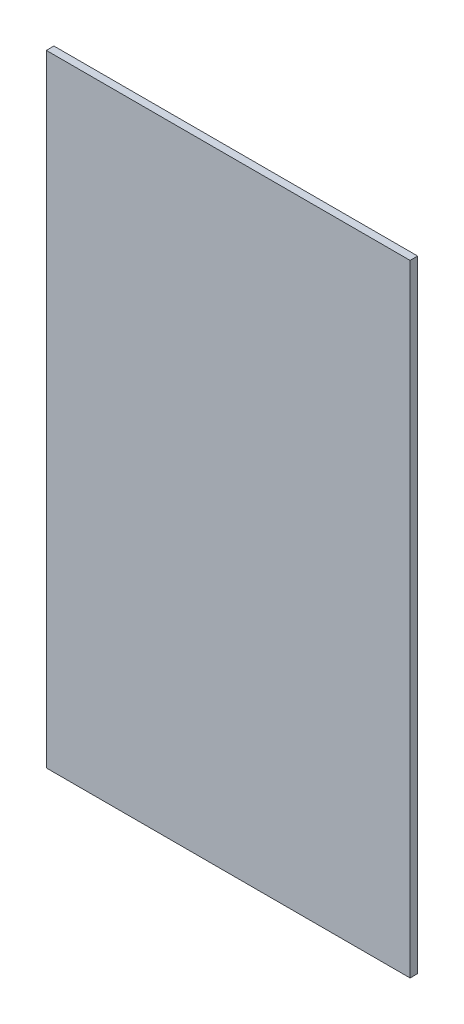
ISO-10303-21;
HEADER;
FILE_DESCRIPTION(('STEP AP214'),'2;1');
FILE_NAME('part.step','',(''),(''),'','','');
FILE_SCHEMA(('AUTOMOTIVE_DESIGN { 1 0 10303 214 1 1 1 1 }'));
ENDSEC;
DATA;
#1=APPLICATION_CONTEXT('core data for automotive mechanical design processes');
#2=APPLICATION_PROTOCOL_DEFINITION('international standard','automotive_design',2000,#1);
#3=PRODUCT_CONTEXT('',#1,'mechanical');
#4=PRODUCT('Part','Part','',(#3));
#5=PRODUCT_RELATED_PRODUCT_CATEGORY('part','',(#4));
#6=PRODUCT_DEFINITION_FORMATION('','',#4);
#7=PRODUCT_DEFINITION_CONTEXT('part definition',#1,'design');
#8=PRODUCT_DEFINITION('design','',#6,#7);
#9=PRODUCT_DEFINITION_SHAPE('','',#8);
#10=(LENGTH_UNIT() NAMED_UNIT(*) SI_UNIT(.MILLI.,.METRE.));
#11=(NAMED_UNIT(*) PLANE_ANGLE_UNIT() SI_UNIT($,.RADIAN.));
#12=(NAMED_UNIT(*) SI_UNIT($,.STERADIAN.) SOLID_ANGLE_UNIT());
#13=UNCERTAINTY_MEASURE_WITH_UNIT(LENGTH_MEASURE(1.E-05),#10,'distance_accuracy_value','');
#14=(GEOMETRIC_REPRESENTATION_CONTEXT(3) GLOBAL_UNCERTAINTY_ASSIGNED_CONTEXT((#13)) GLOBAL_UNIT_ASSIGNED_CONTEXT((#10,
#11,#12)) REPRESENTATION_CONTEXT('',''));
#15=CARTESIAN_POINT('',(0.,0.,0.));
#16=DIRECTION('',(0.,0.,1.));
#17=DIRECTION('',(1.,0.,0.));
#18=AXIS2_PLACEMENT_3D('',#15,#16,#17);
#19=CARTESIAN_POINT('',(0.,0.,5.));
#20=DIRECTION('',(1.,0.,0.));
#21=DIRECTION('',(0.,1.,0.));
#22=AXIS2_PLACEMENT_3D('',#19,#20,#21);
#23=PLANE('',#22);
#24=DIRECTION('',(0.,-1.,0.));
#25=VECTOR('',#24,1.);
#26=CARTESIAN_POINT('',(0.,0.,0.));
#27=LINE('',#26,#25);
#28=CARTESIAN_POINT('',(0.,0.,0.));
#29=VERTEX_POINT('',#28);
#30=CARTESIAN_POINT('',(0.,-410.,0.));
#31=VERTEX_POINT('',#30);
#32=EDGE_CURVE('E95',#29,#31,#27,.T.);
#33=ORIENTED_EDGE('',*,*,#32,.T.);
#34=DIRECTION('',(0.,0.,-1.));
#35=VECTOR('',#34,1.);
#36=CARTESIAN_POINT('',(0.,-410.,5.));
#37=LINE('',#36,#35);
#38=CARTESIAN_POINT('',(0.,-410.,5.));
#39=VERTEX_POINT('',#38);
#40=EDGE_CURVE('E11',#39,#31,#37,.T.);
#41=ORIENTED_EDGE('',*,*,#40,.F.);
#42=DIRECTION('',(0.,-1.,0.));
#43=VECTOR('',#42,1.);
#44=CARTESIAN_POINT('',(0.,0.,5.));
#45=LINE('',#44,#43);
#46=CARTESIAN_POINT('',(0.,0.,5.));
#47=VERTEX_POINT('',#46);
#48=EDGE_CURVE('E83',#47,#39,#45,.T.);
#49=ORIENTED_EDGE('',*,*,#48,.F.);
#50=DIRECTION('',(0.,0.,-1.));
#51=VECTOR('',#50,1.);
#52=CARTESIAN_POINT('',(0.,0.,5.));
#53=LINE('',#52,#51);
#54=EDGE_CURVE('E91',#47,#29,#53,.T.);
#55=ORIENTED_EDGE('',*,*,#54,.T.);
#56=EDGE_LOOP('',(#33,#41,#49,#55));
#57=FACE_BOUND('',#56,.T.);
#58=ADVANCED_FACE('F32',(#57),#23,.F.);
#59=CARTESIAN_POINT('',(0.,-410.,5.));
#60=DIRECTION('',(0.,1.,0.));
#61=DIRECTION('',(0.,0.,1.));
#62=AXIS2_PLACEMENT_3D('',#59,#60,#61);
#63=PLANE('',#62);
#64=DIRECTION('',(1.,0.,0.));
#65=VECTOR('',#64,1.);
#66=CARTESIAN_POINT('',(0.,-410.,0.));
#67=LINE('',#66,#65);
#68=CARTESIAN_POINT('',(240.,-410.,0.));
#69=VERTEX_POINT('',#68);
#70=EDGE_CURVE('E87',#31,#69,#67,.T.);
#71=ORIENTED_EDGE('',*,*,#70,.T.);
#72=DIRECTION('',(0.,0.,-1.));
#73=VECTOR('',#72,1.);
#74=CARTESIAN_POINT('',(240.,-410.,5.));
#75=LINE('',#74,#73);
#76=CARTESIAN_POINT('',(240.,-410.,5.));
#77=VERTEX_POINT('',#76);
#78=EDGE_CURVE('E40',#77,#69,#75,.T.);
#79=ORIENTED_EDGE('',*,*,#78,.F.);
#80=DIRECTION('',(1.,0.,0.));
#81=VECTOR('',#80,1.);
#82=CARTESIAN_POINT('',(0.,-410.,5.));
#83=LINE('',#82,#81);
#84=EDGE_CURVE('E78',#39,#77,#83,.T.);
#85=ORIENTED_EDGE('',*,*,#84,.F.);
#86=ORIENTED_EDGE('',*,*,#40,.T.);
#87=EDGE_LOOP('',(#71,#79,#85,#86));
#88=FACE_BOUND('',#87,.T.);
#89=ADVANCED_FACE('F86',(#88),#63,.F.);
#90=CARTESIAN_POINT('',(240.,0.,5.));
#91=DIRECTION('',(-1.,0.,0.));
#92=DIRECTION('',(0.,-1.,0.));
#93=AXIS2_PLACEMENT_3D('',#90,#91,#92);
#94=PLANE('',#93);
#95=DIRECTION('',(0.,1.,0.));
#96=VECTOR('',#95,1.);
#97=CARTESIAN_POINT('',(240.,0.,0.));
#98=LINE('',#97,#96);
#99=CARTESIAN_POINT('',(240.,0.,0.));
#100=VERTEX_POINT('',#99);
#101=EDGE_CURVE('E65',#69,#100,#98,.T.);
#102=ORIENTED_EDGE('',*,*,#101,.T.);
#103=DIRECTION('',(0.,0.,-1.));
#104=VECTOR('',#103,1.);
#105=CARTESIAN_POINT('',(240.,0.,5.));
#106=LINE('',#105,#104);
#107=CARTESIAN_POINT('',(240.,0.,5.));
#108=VERTEX_POINT('',#107);
#109=EDGE_CURVE('E88',#108,#100,#106,.T.);
#110=ORIENTED_EDGE('',*,*,#109,.F.);
#111=DIRECTION('',(0.,1.,0.));
#112=VECTOR('',#111,1.);
#113=CARTESIAN_POINT('',(240.,0.,5.));
#114=LINE('',#113,#112);
#115=EDGE_CURVE('E81',#77,#108,#114,.T.);
#116=ORIENTED_EDGE('',*,*,#115,.F.);
#117=ORIENTED_EDGE('',*,*,#78,.T.);
#118=EDGE_LOOP('',(#102,#110,#116,#117));
#119=FACE_BOUND('',#118,.T.);
#120=ADVANCED_FACE('F89',(#119),#94,.F.);
#121=CARTESIAN_POINT('',(0.,0.,5.));
#122=DIRECTION('',(0.,-1.,0.));
#123=DIRECTION('',(0.,0.,-1.));
#124=AXIS2_PLACEMENT_3D('',#121,#122,#123);
#125=PLANE('',#124);
#126=DIRECTION('',(-1.,0.,0.));
#127=VECTOR('',#126,1.);
#128=CARTESIAN_POINT('',(0.,0.,0.));
#129=LINE('',#128,#127);
#130=EDGE_CURVE('E71',#100,#29,#129,.T.);
#131=ORIENTED_EDGE('',*,*,#130,.T.);
#132=ORIENTED_EDGE('',*,*,#54,.F.);
#133=DIRECTION('',(-1.,0.,0.));
#134=VECTOR('',#133,1.);
#135=CARTESIAN_POINT('',(0.,0.,5.));
#136=LINE('',#135,#134);
#137=EDGE_CURVE('E48',#108,#47,#136,.T.);
#138=ORIENTED_EDGE('',*,*,#137,.F.);
#139=ORIENTED_EDGE('',*,*,#109,.T.);
#140=EDGE_LOOP('',(#131,#132,#138,#139));
#141=FACE_BOUND('',#140,.T.);
#142=ADVANCED_FACE('F102',(#141),#125,.F.);
#143=CARTESIAN_POINT('',(0.,0.,5.));
#144=DIRECTION('',(0.,0.,1.));
#145=DIRECTION('',(1.,0.,0.));
#146=AXIS2_PLACEMENT_3D('',#143,#144,#145);
#147=PLANE('',#146);
#148=ORIENTED_EDGE('',*,*,#48,.T.);
#149=ORIENTED_EDGE('',*,*,#84,.T.);
#150=ORIENTED_EDGE('',*,*,#115,.T.);
#151=ORIENTED_EDGE('',*,*,#137,.T.);
#152=EDGE_LOOP('',(#148,#149,#150,#151));
#153=FACE_BOUND('',#152,.T.);
#154=ADVANCED_FACE('F79',(#153),#147,.T.);
#155=CARTESIAN_POINT('',(0.,0.,0.));
#156=DIRECTION('',(0.,0.,1.));
#157=DIRECTION('',(1.,0.,0.));
#158=AXIS2_PLACEMENT_3D('',#155,#156,#157);
#159=PLANE('',#158);
#160=ORIENTED_EDGE('',*,*,#32,.F.);
#161=ORIENTED_EDGE('',*,*,#130,.F.);
#162=ORIENTED_EDGE('',*,*,#101,.F.);
#163=ORIENTED_EDGE('',*,*,#70,.F.);
#164=EDGE_LOOP('',(#160,#161,#162,#163));
#165=FACE_BOUND('',#164,.T.);
#166=ADVANCED_FACE('F105',(#165),#159,.F.);
#167=CLOSED_SHELL('',(#58,#89,#120,#142,#154,#166));
#168=MANIFOLD_SOLID_BREP('B2',#167);
#169=ADVANCED_BREP_SHAPE_REPRESENTATION('',(#18,#168),#14);
#170=SHAPE_DEFINITION_REPRESENTATION(#9,#169);
ENDSEC;
END-ISO-10303-21;
